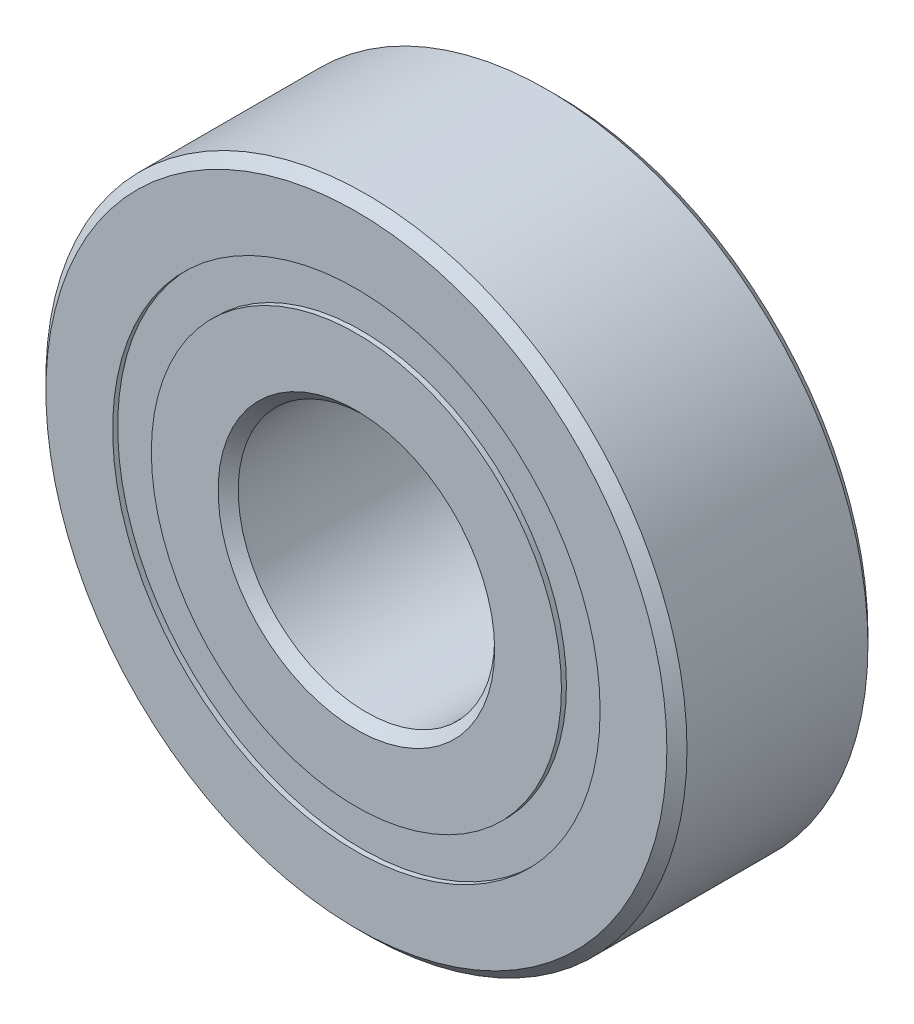
ISO-10303-21;
HEADER;
FILE_DESCRIPTION(('STEP AP214'),'2;1');
FILE_NAME('part.step','',(''),(''),'','','');
FILE_SCHEMA(('AUTOMOTIVE_DESIGN { 1 0 10303 214 1 1 1 1 }'));
ENDSEC;
DATA;
#1=APPLICATION_CONTEXT('core data for automotive mechanical design processes');
#2=APPLICATION_PROTOCOL_DEFINITION('international standard','automotive_design',2000,#1);
#3=PRODUCT_CONTEXT('',#1,'mechanical');
#4=PRODUCT('Part','Part','',(#3));
#5=PRODUCT_RELATED_PRODUCT_CATEGORY('part','',(#4));
#6=PRODUCT_DEFINITION_FORMATION('','',#4);
#7=PRODUCT_DEFINITION_CONTEXT('part definition',#1,'design');
#8=PRODUCT_DEFINITION('design','',#6,#7);
#9=PRODUCT_DEFINITION_SHAPE('','',#8);
#10=(LENGTH_UNIT() NAMED_UNIT(*) SI_UNIT(.MILLI.,.METRE.));
#11=(NAMED_UNIT(*) PLANE_ANGLE_UNIT() SI_UNIT($,.RADIAN.));
#12=(NAMED_UNIT(*) SI_UNIT($,.STERADIAN.) SOLID_ANGLE_UNIT());
#13=UNCERTAINTY_MEASURE_WITH_UNIT(LENGTH_MEASURE(1.E-05),#10,'distance_accuracy_value','');
#14=(GEOMETRIC_REPRESENTATION_CONTEXT(3) GLOBAL_UNCERTAINTY_ASSIGNED_CONTEXT((#13)) GLOBAL_UNIT_ASSIGNED_CONTEXT((#10,
#11,#12)) REPRESENTATION_CONTEXT('',''));
#15=CARTESIAN_POINT('',(0.,0.,0.));
#16=DIRECTION('',(0.,0.,1.));
#17=DIRECTION('',(1.,0.,0.));
#18=AXIS2_PLACEMENT_3D('',#15,#16,#17);
#19=CARTESIAN_POINT('',(0.,6.03522142857143,-2.36474));
#20=DIRECTION('',(0.,0.,1.));
#21=DIRECTION('',(1.,0.,0.));
#22=AXIS2_PLACEMENT_3D('',#19,#20,#21);
#23=PLANE('',#22);
#24=CARTESIAN_POINT('',(0.,0.,-2.36474));
#25=DIRECTION('',(0.,0.,1.));
#26=DIRECTION('',(1.,0.,0.));
#27=AXIS2_PLACEMENT_3D('',#24,#25,#26);
#28=CIRCLE('',#27,6.03522142857143);
#29=CARTESIAN_POINT('',(6.03522142857143,0.,-2.36474));
#30=VERTEX_POINT('',#29);
#31=EDGE_CURVE('E60',#30,#30,#28,.T.);
#32=ORIENTED_EDGE('',*,*,#31,.F.);
#33=EDGE_LOOP('',(#32));
#34=FACE_BOUND('',#33,.T.);
#35=CARTESIAN_POINT('',(0.,0.,-2.36474));
#36=DIRECTION('',(0.,0.,1.));
#37=DIRECTION('',(1.,0.,0.));
#38=AXIS2_PLACEMENT_3D('',#35,#36,#37);
#39=CIRCLE('',#38,5.07727857142857);
#40=CARTESIAN_POINT('',(5.07727857142857,0.,-2.36474));
#41=VERTEX_POINT('',#40);
#42=EDGE_CURVE('E11',#41,#41,#39,.T.);
#43=ORIENTED_EDGE('',*,*,#42,.T.);
#44=EDGE_LOOP('',(#43));
#45=FACE_BOUND('',#44,.T.);
#46=ADVANCED_FACE('F46',(#34,#45),#23,.F.);
#47=CARTESIAN_POINT('',(0.,0.,2.4892));
#48=DIRECTION('',(0.,0.,1.));
#49=DIRECTION('',(1.,0.,0.));
#50=AXIS2_PLACEMENT_3D('',#47,#48,#49);
#51=CYLINDRICAL_SURFACE('',#50,5.07727857142857);
#52=ORIENTED_EDGE('',*,*,#42,.F.);
#53=EDGE_LOOP('',(#52));
#54=FACE_BOUND('',#53,.T.);
#55=CARTESIAN_POINT('',(0.,0.,-1.20554465033679));
#56=DIRECTION('',(0.,0.,1.));
#57=DIRECTION('',(1.,0.,0.));
#58=AXIS2_PLACEMENT_3D('',#55,#56,#57);
#59=CIRCLE('',#58,5.07727857142857);
#60=CARTESIAN_POINT('',(5.07727857142857,0.,-1.20554465033679));
#61=VERTEX_POINT('',#60);
#62=EDGE_CURVE('E52',#61,#61,#59,.T.);
#63=ORIENTED_EDGE('',*,*,#62,.T.);
#64=EDGE_LOOP('',(#63));
#65=FACE_BOUND('',#64,.T.);
#66=ADVANCED_FACE('F69',(#54,#65),#51,.F.);
#67=CARTESIAN_POINT('',(0.,6.03522142857143,-1.20554465033679));
#68=DIRECTION('',(0.,0.,-1.));
#69=DIRECTION('',(-1.,0.,0.));
#70=AXIS2_PLACEMENT_3D('',#67,#68,#69);
#71=PLANE('',#70);
#72=ORIENTED_EDGE('',*,*,#62,.F.);
#73=EDGE_LOOP('',(#72));
#74=FACE_BOUND('',#73,.T.);
#75=CARTESIAN_POINT('',(0.,0.,-1.20554465033679));
#76=DIRECTION('',(0.,0.,1.));
#77=DIRECTION('',(1.,0.,0.));
#78=AXIS2_PLACEMENT_3D('',#75,#76,#77);
#79=CIRCLE('',#78,6.03522142857143);
#80=CARTESIAN_POINT('',(6.03522142857143,0.,-1.20554465033679));
#81=VERTEX_POINT('',#80);
#82=EDGE_CURVE('E56',#81,#81,#79,.T.);
#83=ORIENTED_EDGE('',*,*,#82,.T.);
#84=EDGE_LOOP('',(#83));
#85=FACE_BOUND('',#84,.T.);
#86=ADVANCED_FACE('F73',(#74,#85),#71,.F.);
#87=CARTESIAN_POINT('',(0.,0.,2.4892));
#88=DIRECTION('',(0.,0.,1.));
#89=DIRECTION('',(1.,0.,0.));
#90=AXIS2_PLACEMENT_3D('',#87,#88,#89);
#91=CYLINDRICAL_SURFACE('',#90,6.03522142857143);
#92=ORIENTED_EDGE('',*,*,#82,.F.);
#93=EDGE_LOOP('',(#92));
#94=FACE_BOUND('',#93,.T.);
#95=ORIENTED_EDGE('',*,*,#31,.T.);
#96=EDGE_LOOP('',(#95));
#97=FACE_BOUND('',#96,.T.);
#98=ADVANCED_FACE('F66',(#94,#97),#91,.T.);
#99=CLOSED_SHELL('',(#46,#66,#86,#98));
#100=MANIFOLD_SOLID_BREP('B2',#99);
#101=CARTESIAN_POINT('',(0.,6.03522142857143,2.36474));
#102=DIRECTION('',(0.,0.,-1.));
#103=DIRECTION('',(-1.,0.,0.));
#104=AXIS2_PLACEMENT_3D('',#101,#102,#103);
#105=PLANE('',#104);
#106=CARTESIAN_POINT('',(0.,0.,2.36474));
#107=DIRECTION('',(0.,0.,1.));
#108=DIRECTION('',(1.,0.,0.));
#109=AXIS2_PLACEMENT_3D('',#106,#107,#108);
#110=CIRCLE('',#109,5.07727857142857);
#111=CARTESIAN_POINT('',(5.07727857142857,0.,2.36474));
#112=VERTEX_POINT('',#111);
#113=EDGE_CURVE('E45',#112,#112,#110,.T.);
#114=ORIENTED_EDGE('',*,*,#113,.F.);
#115=EDGE_LOOP('',(#114));
#116=FACE_BOUND('',#115,.T.);
#117=CARTESIAN_POINT('',(0.,0.,2.36474));
#118=DIRECTION('',(0.,0.,1.));
#119=DIRECTION('',(1.,0.,0.));
#120=AXIS2_PLACEMENT_3D('',#117,#118,#119);
#121=CIRCLE('',#120,6.03522142857143);
#122=CARTESIAN_POINT('',(6.03522142857143,0.,2.36474));
#123=VERTEX_POINT('',#122);
#124=EDGE_CURVE('E128',#123,#123,#121,.T.);
#125=ORIENTED_EDGE('',*,*,#124,.T.);
#126=EDGE_LOOP('',(#125));
#127=FACE_BOUND('',#126,.T.);
#128=ADVANCED_FACE('F114',(#116,#127),#105,.F.);
#129=CARTESIAN_POINT('',(0.,0.,2.4892));
#130=DIRECTION('',(0.,0.,1.));
#131=DIRECTION('',(1.,0.,0.));
#132=AXIS2_PLACEMENT_3D('',#129,#130,#131);
#133=CYLINDRICAL_SURFACE('',#132,5.07727857142857);
#134=CARTESIAN_POINT('',(0.,0.,1.20554465033679));
#135=DIRECTION('',(0.,0.,1.));
#136=DIRECTION('',(1.,0.,0.));
#137=AXIS2_PLACEMENT_3D('',#134,#135,#136);
#138=CIRCLE('',#137,5.07727857142857);
#139=CARTESIAN_POINT('',(5.07727857142857,0.,1.20554465033679));
#140=VERTEX_POINT('',#139);
#141=EDGE_CURVE('E120',#140,#140,#138,.T.);
#142=ORIENTED_EDGE('',*,*,#141,.F.);
#143=EDGE_LOOP('',(#142));
#144=FACE_BOUND('',#143,.T.);
#145=ORIENTED_EDGE('',*,*,#113,.T.);
#146=EDGE_LOOP('',(#145));
#147=FACE_BOUND('',#146,.T.);
#148=ADVANCED_FACE('F143',(#144,#147),#133,.F.);
#149=CARTESIAN_POINT('',(0.,6.03522142857143,1.20554465033679));
#150=DIRECTION('',(0.,0.,1.));
#151=DIRECTION('',(1.,0.,0.));
#152=AXIS2_PLACEMENT_3D('',#149,#150,#151);
#153=PLANE('',#152);
#154=CARTESIAN_POINT('',(0.,0.,1.20554465033679));
#155=DIRECTION('',(0.,0.,1.));
#156=DIRECTION('',(1.,0.,0.));
#157=AXIS2_PLACEMENT_3D('',#154,#155,#156);
#158=CIRCLE('',#157,6.03522142857143);
#159=CARTESIAN_POINT('',(6.03522142857143,0.,1.20554465033679));
#160=VERTEX_POINT('',#159);
#161=EDGE_CURVE('E124',#160,#160,#158,.T.);
#162=ORIENTED_EDGE('',*,*,#161,.F.);
#163=EDGE_LOOP('',(#162));
#164=FACE_BOUND('',#163,.T.);
#165=ORIENTED_EDGE('',*,*,#141,.T.);
#166=EDGE_LOOP('',(#165));
#167=FACE_BOUND('',#166,.T.);
#168=ADVANCED_FACE('F138',(#164,#167),#153,.F.);
#169=CARTESIAN_POINT('',(0.,0.,2.4892));
#170=DIRECTION('',(0.,0.,1.));
#171=DIRECTION('',(1.,0.,0.));
#172=AXIS2_PLACEMENT_3D('',#169,#170,#171);
#173=CYLINDRICAL_SURFACE('',#172,6.03522142857143);
#174=ORIENTED_EDGE('',*,*,#124,.F.);
#175=EDGE_LOOP('',(#174));
#176=FACE_BOUND('',#175,.T.);
#177=ORIENTED_EDGE('',*,*,#161,.T.);
#178=EDGE_LOOP('',(#177));
#179=FACE_BOUND('',#178,.T.);
#180=ADVANCED_FACE('F135',(#176,#179),#173,.T.);
#181=CLOSED_SHELL('',(#128,#148,#168,#180));
#182=MANIFOLD_SOLID_BREP('B6',#181);
#183=CARTESIAN_POINT('',(-3.92886205296771,3.9288620529678,0.));
#184=DIRECTION('',(0.,0.,1.));
#185=DIRECTION('',(-0.707106781186539,0.707106781186556,0.));
#186=AXIS2_PLACEMENT_3D('',#183,#184,#185);
#187=SPHERICAL_SURFACE('',#186,1.20554465033679);
#188=CARTESIAN_POINT('',(-3.92886205296771,3.9288620529678,1.20554465033679));
#189=VERTEX_POINT('',#188);
#190=VERTEX_LOOP('',#189);
#191=FACE_BOUND('',#190,.T.);
#192=ADVANCED_FACE('F182',(#191),#187,.T.);
#193=CLOSED_SHELL('',(#192));
#194=MANIFOLD_SOLID_BREP('B40',#193);
#195=CARTESIAN_POINT('',(-5.55625,0.,0.));
#196=DIRECTION('',(0.,0.,1.));
#197=DIRECTION('',(-1.,0.,0.));
#198=AXIS2_PLACEMENT_3D('',#195,#196,#197);
#199=SPHERICAL_SURFACE('',#198,1.20554465033679);
#200=CARTESIAN_POINT('',(-5.55625,0.,1.20554465033679));
#201=VERTEX_POINT('',#200);
#202=VERTEX_LOOP('',#201);
#203=FACE_BOUND('',#202,.T.);
#204=ADVANCED_FACE('F203',(#203),#199,.T.);
#205=CLOSED_SHELL('',(#204));
#206=MANIFOLD_SOLID_BREP('B110',#205);
#207=CARTESIAN_POINT('',(-3.92886205296779,-3.92886205296772,0.));
#208=DIRECTION('',(0.,0.,1.));
#209=DIRECTION('',(-0.707106781186554,-0.707106781186541,0.));
#210=AXIS2_PLACEMENT_3D('',#207,#208,#209);
#211=SPHERICAL_SURFACE('',#210,1.20554465033679);
#212=CARTESIAN_POINT('',(-3.92886205296779,-3.92886205296772,1.20554465033679));
#213=VERTEX_POINT('',#212);
#214=VERTEX_LOOP('',#213);
#215=FACE_BOUND('',#214,.T.);
#216=ADVANCED_FACE('F224',(#215),#211,.T.);
#217=CLOSED_SHELL('',(#216));
#218=MANIFOLD_SOLID_BREP('B178',#217);
#219=CARTESIAN_POINT('',(0.,-5.55625,0.));
#220=DIRECTION('',(0.,0.,1.));
#221=DIRECTION('',(0.,-1.,0.));
#222=AXIS2_PLACEMENT_3D('',#219,#220,#221);
#223=SPHERICAL_SURFACE('',#222,1.20554465033679);
#224=CARTESIAN_POINT('',(0.,-5.55625,1.20554465033679));
#225=VERTEX_POINT('',#224);
#226=VERTEX_LOOP('',#225);
#227=FACE_BOUND('',#226,.T.);
#228=ADVANCED_FACE('F245',(#227),#223,.T.);
#229=CLOSED_SHELL('',(#228));
#230=MANIFOLD_SOLID_BREP('B199',#229);
#231=CARTESIAN_POINT('',(3.92886205296773,-3.92886205296778,0.));
#232=DIRECTION('',(0.,0.,1.));
#233=DIRECTION('',(0.707106781186544,-0.707106781186551,0.));
#234=AXIS2_PLACEMENT_3D('',#231,#232,#233);
#235=SPHERICAL_SURFACE('',#234,1.20554465033679);
#236=CARTESIAN_POINT('',(3.92886205296773,-3.92886205296778,1.20554465033679));
#237=VERTEX_POINT('',#236);
#238=VERTEX_LOOP('',#237);
#239=FACE_BOUND('',#238,.T.);
#240=ADVANCED_FACE('F266',(#239),#235,.T.);
#241=CLOSED_SHELL('',(#240));
#242=MANIFOLD_SOLID_BREP('B220',#241);
#243=CARTESIAN_POINT('',(5.55625,0.,0.));
#244=DIRECTION('',(0.,0.,1.));
#245=DIRECTION('',(1.,0.,0.));
#246=AXIS2_PLACEMENT_3D('',#243,#244,#245);
#247=SPHERICAL_SURFACE('',#246,1.20554465033679);
#248=CARTESIAN_POINT('',(5.55625,0.,1.20554465033679));
#249=VERTEX_POINT('',#248);
#250=VERTEX_LOOP('',#249);
#251=FACE_BOUND('',#250,.T.);
#252=ADVANCED_FACE('F287',(#251),#247,.T.);
#253=CLOSED_SHELL('',(#252));
#254=MANIFOLD_SOLID_BREP('B241',#253);
#255=CARTESIAN_POINT('',(3.92886205296776,3.92886205296775,0.));
#256=DIRECTION('',(0.,0.,1.));
#257=DIRECTION('',(0.707106781186549,0.707106781186546,0.));
#258=AXIS2_PLACEMENT_3D('',#255,#256,#257);
#259=SPHERICAL_SURFACE('',#258,1.20554465033679);
#260=CARTESIAN_POINT('',(3.92886205296776,3.92886205296775,1.20554465033679));
#261=VERTEX_POINT('',#260);
#262=VERTEX_LOOP('',#261);
#263=FACE_BOUND('',#262,.T.);
#264=ADVANCED_FACE('F308',(#263),#259,.T.);
#265=CLOSED_SHELL('',(#264));
#266=MANIFOLD_SOLID_BREP('B262',#265);
#267=CARTESIAN_POINT('',(0.,5.55625,0.));
#268=DIRECTION('',(0.,0.,1.));
#269=DIRECTION('',(0.,1.,0.));
#270=AXIS2_PLACEMENT_3D('',#267,#268,#269);
#271=SPHERICAL_SURFACE('',#270,1.20554465033679);
#272=CARTESIAN_POINT('',(0.,5.55625,1.20554465033679));
#273=VERTEX_POINT('',#272);
#274=VERTEX_LOOP('',#273);
#275=FACE_BOUND('',#274,.T.);
#276=ADVANCED_FACE('F331',(#275),#271,.T.);
#277=CLOSED_SHELL('',(#276));
#278=MANIFOLD_SOLID_BREP('B283',#277);
#279=CARTESIAN_POINT('',(0.,5.07727857142857,2.4892));
#280=DIRECTION('',(0.,0.,-1.));
#281=DIRECTION('',(-1.,0.,0.));
#282=AXIS2_PLACEMENT_3D('',#279,#280,#281);
#283=PLANE('',#282);
#284=CARTESIAN_POINT('',(0.,0.,2.4892));
#285=DIRECTION('',(0.,0.,1.));
#286=DIRECTION('',(1.,0.,0.));
#287=AXIS2_PLACEMENT_3D('',#284,#285,#286);
#288=CIRCLE('',#287,3.42392);
#289=CARTESIAN_POINT('',(3.42392,0.,2.4892));
#290=VERTEX_POINT('',#289);
#291=EDGE_CURVE('E379',#290,#290,#288,.T.);
#292=ORIENTED_EDGE('',*,*,#291,.F.);
#293=EDGE_LOOP('',(#292));
#294=FACE_BOUND('',#293,.T.);
#295=CARTESIAN_POINT('',(0.,0.,2.4892));
#296=DIRECTION('',(0.,0.,1.));
#297=DIRECTION('',(1.,0.,0.));
#298=AXIS2_PLACEMENT_3D('',#295,#296,#297);
#299=CIRCLE('',#298,5.07727857142857);
#300=CARTESIAN_POINT('',(5.07727857142857,0.,2.4892));
#301=VERTEX_POINT('',#300);
#302=EDGE_CURVE('E330',#301,#301,#299,.T.);
#303=ORIENTED_EDGE('',*,*,#302,.T.);
#304=EDGE_LOOP('',(#303));
#305=FACE_BOUND('',#304,.T.);
#306=ADVANCED_FACE('F351',(#294,#305),#283,.F.);
#307=CARTESIAN_POINT('',(0.,0.,2.4892));
#308=DIRECTION('',(0.,0.,1.));
#309=DIRECTION('',(1.,0.,0.));
#310=AXIS2_PLACEMENT_3D('',#307,#308,#309);
#311=CYLINDRICAL_SURFACE('',#310,5.07727857142857);
#312=ORIENTED_EDGE('',*,*,#302,.F.);
#313=EDGE_LOOP('',(#312));
#314=FACE_BOUND('',#313,.T.);
#315=CARTESIAN_POINT('',(0.,0.,1.10631111111111));
#316=DIRECTION('',(0.,0.,1.));
#317=DIRECTION('',(1.,0.,0.));
#318=AXIS2_PLACEMENT_3D('',#315,#316,#317);
#319=CIRCLE('',#318,5.07727857142857);
#320=CARTESIAN_POINT('',(5.07727857142857,0.,1.10631111111111));
#321=VERTEX_POINT('',#320);
#322=EDGE_CURVE('E357',#321,#321,#319,.T.);
#323=ORIENTED_EDGE('',*,*,#322,.T.);
#324=EDGE_LOOP('',(#323));
#325=FACE_BOUND('',#324,.T.);
#326=ADVANCED_FACE('F386',(#314,#325),#311,.T.);
#327=CARTESIAN_POINT('',(0.,0.,0.));
#328=DIRECTION('',(0.,0.,1.));
#329=DIRECTION('',(1.,0.,0.));
#330=AXIS2_PLACEMENT_3D('',#327,#328,#329);
#331=TOROIDAL_SURFACE('',#330,5.55625,1.20554465033679);
#332=ORIENTED_EDGE('',*,*,#322,.F.);
#333=EDGE_LOOP('',(#332));
#334=FACE_BOUND('',#333,.T.);
#335=CARTESIAN_POINT('',(0.,0.,-1.10631111111111));
#336=DIRECTION('',(0.,0.,1.));
#337=DIRECTION('',(1.,0.,0.));
#338=AXIS2_PLACEMENT_3D('',#335,#336,#337);
#339=CIRCLE('',#338,5.07727857142857);
#340=CARTESIAN_POINT('',(5.07727857142857,0.,-1.10631111111111));
#341=VERTEX_POINT('',#340);
#342=EDGE_CURVE('E361',#341,#341,#339,.T.);
#343=ORIENTED_EDGE('',*,*,#342,.T.);
#344=EDGE_LOOP('',(#343));
#345=FACE_BOUND('',#344,.T.);
#346=ADVANCED_FACE('F390',(#334,#345),#331,.F.);
#347=CARTESIAN_POINT('',(0.,0.,2.4892));
#348=DIRECTION('',(0.,0.,1.));
#349=DIRECTION('',(1.,0.,0.));
#350=AXIS2_PLACEMENT_3D('',#347,#348,#349);
#351=CYLINDRICAL_SURFACE('',#350,5.07727857142857);
#352=ORIENTED_EDGE('',*,*,#342,.F.);
#353=EDGE_LOOP('',(#352));
#354=FACE_BOUND('',#353,.T.);
#355=CARTESIAN_POINT('',(0.,0.,-2.4892));
#356=DIRECTION('',(0.,0.,1.));
#357=DIRECTION('',(1.,0.,0.));
#358=AXIS2_PLACEMENT_3D('',#355,#356,#357);
#359=CIRCLE('',#358,5.07727857142857);
#360=CARTESIAN_POINT('',(5.07727857142857,0.,-2.4892));
#361=VERTEX_POINT('',#360);
#362=EDGE_CURVE('E365',#361,#361,#359,.T.);
#363=ORIENTED_EDGE('',*,*,#362,.T.);
#364=EDGE_LOOP('',(#363));
#365=FACE_BOUND('',#364,.T.);
#366=ADVANCED_FACE('F395',(#354,#365),#351,.T.);
#367=CARTESIAN_POINT('',(0.,3.42392,-2.4892));
#368=DIRECTION('',(0.,0.,1.));
#369=DIRECTION('',(1.,0.,0.));
#370=AXIS2_PLACEMENT_3D('',#367,#368,#369);
#371=PLANE('',#370);
#372=ORIENTED_EDGE('',*,*,#362,.F.);
#373=EDGE_LOOP('',(#372));
#374=FACE_BOUND('',#373,.T.);
#375=CARTESIAN_POINT('',(0.,0.,-2.4892));
#376=DIRECTION('',(0.,0.,1.));
#377=DIRECTION('',(1.,0.,0.));
#378=AXIS2_PLACEMENT_3D('',#375,#376,#377);
#379=CIRCLE('',#378,3.42392);
#380=CARTESIAN_POINT('',(3.42392,0.,-2.4892));
#381=VERTEX_POINT('',#380);
#382=EDGE_CURVE('E370',#381,#381,#379,.T.);
#383=ORIENTED_EDGE('',*,*,#382,.T.);
#384=EDGE_LOOP('',(#383));
#385=FACE_BOUND('',#384,.T.);
#386=ADVANCED_FACE('F401',(#374,#385),#371,.F.);
#387=CARTESIAN_POINT('',(0.,0.,-2.24028));
#388=DIRECTION('',(0.,0.,-1.));
#389=DIRECTION('',(-1.,0.,0.));
#390=AXIS2_PLACEMENT_3D('',#387,#388,#389);
#391=CONICAL_SURFACE('',#390,3.175,0.78539816339744);
#392=ORIENTED_EDGE('',*,*,#382,.F.);
#393=EDGE_LOOP('',(#392));
#394=FACE_BOUND('',#393,.T.);
#395=CARTESIAN_POINT('',(0.,0.,-2.24028));
#396=DIRECTION('',(0.,0.,1.));
#397=DIRECTION('',(1.,0.,0.));
#398=AXIS2_PLACEMENT_3D('',#395,#396,#397);
#399=CIRCLE('',#398,3.175);
#400=CARTESIAN_POINT('',(3.175,0.,-2.24028));
#401=VERTEX_POINT('',#400);
#402=EDGE_CURVE('E373',#401,#401,#399,.T.);
#403=ORIENTED_EDGE('',*,*,#402,.T.);
#404=EDGE_LOOP('',(#403));
#405=FACE_BOUND('',#404,.T.);
#406=ADVANCED_FACE('F405',(#394,#405),#391,.F.);
#407=CARTESIAN_POINT('',(0.,0.,2.4892));
#408=DIRECTION('',(0.,0.,1.));
#409=DIRECTION('',(1.,0.,0.));
#410=AXIS2_PLACEMENT_3D('',#407,#408,#409);
#411=CYLINDRICAL_SURFACE('',#410,3.175);
#412=ORIENTED_EDGE('',*,*,#402,.F.);
#413=EDGE_LOOP('',(#412));
#414=FACE_BOUND('',#413,.T.);
#415=CARTESIAN_POINT('',(0.,0.,2.24028));
#416=DIRECTION('',(0.,0.,1.));
#417=DIRECTION('',(1.,0.,0.));
#418=AXIS2_PLACEMENT_3D('',#415,#416,#417);
#419=CIRCLE('',#418,3.175);
#420=CARTESIAN_POINT('',(3.175,0.,2.24028));
#421=VERTEX_POINT('',#420);
#422=EDGE_CURVE('E376',#421,#421,#419,.T.);
#423=ORIENTED_EDGE('',*,*,#422,.T.);
#424=EDGE_LOOP('',(#423));
#425=FACE_BOUND('',#424,.T.);
#426=ADVANCED_FACE('F409',(#414,#425),#411,.F.);
#427=CARTESIAN_POINT('',(0.,0.,2.4892));
#428=DIRECTION('',(0.,0.,1.));
#429=DIRECTION('',(1.,0.,0.));
#430=AXIS2_PLACEMENT_3D('',#427,#428,#429);
#431=CONICAL_SURFACE('',#430,3.42392,0.785398163397456);
#432=ORIENTED_EDGE('',*,*,#422,.F.);
#433=EDGE_LOOP('',(#432));
#434=FACE_BOUND('',#433,.T.);
#435=ORIENTED_EDGE('',*,*,#291,.T.);
#436=EDGE_LOOP('',(#435));
#437=FACE_BOUND('',#436,.T.);
#438=ADVANCED_FACE('F383',(#434,#437),#431,.F.);
#439=CLOSED_SHELL('',(#306,#326,#346,#366,#386,#406,#426,#438));
#440=MANIFOLD_SOLID_BREP('B304',#439);
#441=CARTESIAN_POINT('',(0.,0.,2.24028));
#442=DIRECTION('',(0.,0.,-1.));
#443=DIRECTION('',(-1.,0.,0.));
#444=AXIS2_PLACEMENT_3D('',#441,#442,#443);
#445=CONICAL_SURFACE('',#444,7.9375,0.785398163397445);
#446=CARTESIAN_POINT('',(0.,0.,2.4892));
#447=DIRECTION('',(0.,0.,1.));
#448=DIRECTION('',(1.,0.,0.));
#449=AXIS2_PLACEMENT_3D('',#446,#447,#448);
#450=CIRCLE('',#449,7.68858);
#451=CARTESIAN_POINT('',(7.68858,0.,2.4892));
#452=VERTEX_POINT('',#451);
#453=EDGE_CURVE('E501',#452,#452,#450,.T.);
#454=ORIENTED_EDGE('',*,*,#453,.F.);
#455=EDGE_LOOP('',(#454));
#456=FACE_BOUND('',#455,.T.);
#457=CARTESIAN_POINT('',(0.,0.,2.24028));
#458=DIRECTION('',(0.,0.,1.));
#459=DIRECTION('',(1.,0.,0.));
#460=AXIS2_PLACEMENT_3D('',#457,#458,#459);
#461=CIRCLE('',#460,7.9375);
#462=CARTESIAN_POINT('',(7.9375,0.,2.24028));
#463=VERTEX_POINT('',#462);
#464=EDGE_CURVE('E350',#463,#463,#461,.T.);
#465=ORIENTED_EDGE('',*,*,#464,.T.);
#466=EDGE_LOOP('',(#465));
#467=FACE_BOUND('',#466,.T.);
#468=ADVANCED_FACE('F473',(#456,#467),#445,.T.);
#469=CARTESIAN_POINT('',(0.,0.,2.4892));
#470=DIRECTION('',(0.,0.,1.));
#471=DIRECTION('',(1.,0.,0.));
#472=AXIS2_PLACEMENT_3D('',#469,#470,#471);
#473=CYLINDRICAL_SURFACE('',#472,7.9375);
#474=ORIENTED_EDGE('',*,*,#464,.F.);
#475=EDGE_LOOP('',(#474));
#476=FACE_BOUND('',#475,.T.);
#477=CARTESIAN_POINT('',(0.,0.,-2.24028));
#478=DIRECTION('',(0.,0.,1.));
#479=DIRECTION('',(1.,0.,0.));
#480=AXIS2_PLACEMENT_3D('',#477,#478,#479);
#481=CIRCLE('',#480,7.9375);
#482=CARTESIAN_POINT('',(7.9375,0.,-2.24028));
#483=VERTEX_POINT('',#482);
#484=EDGE_CURVE('E479',#483,#483,#481,.T.);
#485=ORIENTED_EDGE('',*,*,#484,.T.);
#486=EDGE_LOOP('',(#485));
#487=FACE_BOUND('',#486,.T.);
#488=ADVANCED_FACE('F508',(#476,#487),#473,.T.);
#489=CARTESIAN_POINT('',(0.,0.,-2.4892));
#490=DIRECTION('',(0.,0.,1.));
#491=DIRECTION('',(1.,0.,0.));
#492=AXIS2_PLACEMENT_3D('',#489,#490,#491);
#493=CONICAL_SURFACE('',#492,7.68858,0.785398163397443);
#494=ORIENTED_EDGE('',*,*,#484,.F.);
#495=EDGE_LOOP('',(#494));
#496=FACE_BOUND('',#495,.T.);
#497=CARTESIAN_POINT('',(0.,0.,-2.4892));
#498=DIRECTION('',(0.,0.,1.));
#499=DIRECTION('',(1.,0.,0.));
#500=AXIS2_PLACEMENT_3D('',#497,#498,#499);
#501=CIRCLE('',#500,7.68858);
#502=CARTESIAN_POINT('',(7.68858,0.,-2.4892));
#503=VERTEX_POINT('',#502);
#504=EDGE_CURVE('E483',#503,#503,#501,.T.);
#505=ORIENTED_EDGE('',*,*,#504,.T.);
#506=EDGE_LOOP('',(#505));
#507=FACE_BOUND('',#506,.T.);
#508=ADVANCED_FACE('F512',(#496,#507),#493,.T.);
#509=CARTESIAN_POINT('',(0.,7.68858,-2.4892));
#510=DIRECTION('',(0.,0.,1.));
#511=DIRECTION('',(1.,0.,0.));
#512=AXIS2_PLACEMENT_3D('',#509,#510,#511);
#513=PLANE('',#512);
#514=ORIENTED_EDGE('',*,*,#504,.F.);
#515=EDGE_LOOP('',(#514));
#516=FACE_BOUND('',#515,.T.);
#517=CARTESIAN_POINT('',(0.,0.,-2.4892));
#518=DIRECTION('',(0.,0.,1.));
#519=DIRECTION('',(1.,0.,0.));
#520=AXIS2_PLACEMENT_3D('',#517,#518,#519);
#521=CIRCLE('',#520,6.03522142857143);
#522=CARTESIAN_POINT('',(6.03522142857143,0.,-2.4892));
#523=VERTEX_POINT('',#522);
#524=EDGE_CURVE('E487',#523,#523,#521,.T.);
#525=ORIENTED_EDGE('',*,*,#524,.T.);
#526=EDGE_LOOP('',(#525));
#527=FACE_BOUND('',#526,.T.);
#528=ADVANCED_FACE('F517',(#516,#527),#513,.F.);
#529=CARTESIAN_POINT('',(0.,0.,2.4892));
#530=DIRECTION('',(0.,0.,1.));
#531=DIRECTION('',(1.,0.,0.));
#532=AXIS2_PLACEMENT_3D('',#529,#530,#531);
#533=CYLINDRICAL_SURFACE('',#532,6.03522142857143);
#534=ORIENTED_EDGE('',*,*,#524,.F.);
#535=EDGE_LOOP('',(#534));
#536=FACE_BOUND('',#535,.T.);
#537=CARTESIAN_POINT('',(0.,0.,-1.10631111111111));
#538=DIRECTION('',(0.,0.,1.));
#539=DIRECTION('',(1.,0.,0.));
#540=AXIS2_PLACEMENT_3D('',#537,#538,#539);
#541=CIRCLE('',#540,6.03522142857143);
#542=CARTESIAN_POINT('',(6.03522142857143,0.,-1.10631111111111));
#543=VERTEX_POINT('',#542);
#544=EDGE_CURVE('E492',#543,#543,#541,.T.);
#545=ORIENTED_EDGE('',*,*,#544,.T.);
#546=EDGE_LOOP('',(#545));
#547=FACE_BOUND('',#546,.T.);
#548=ADVANCED_FACE('F523',(#536,#547),#533,.F.);
#549=CARTESIAN_POINT('',(0.,0.,0.));
#550=DIRECTION('',(0.,0.,1.));
#551=DIRECTION('',(1.,0.,0.));
#552=AXIS2_PLACEMENT_3D('',#549,#550,#551);
#553=TOROIDAL_SURFACE('',#552,5.55625,1.20554465033679);
#554=ORIENTED_EDGE('',*,*,#544,.F.);
#555=EDGE_LOOP('',(#554));
#556=FACE_BOUND('',#555,.T.);
#557=CARTESIAN_POINT('',(0.,0.,1.10631111111111));
#558=DIRECTION('',(0.,0.,1.));
#559=DIRECTION('',(1.,0.,0.));
#560=AXIS2_PLACEMENT_3D('',#557,#558,#559);
#561=CIRCLE('',#560,6.03522142857143);
#562=CARTESIAN_POINT('',(6.03522142857143,0.,1.10631111111111));
#563=VERTEX_POINT('',#562);
#564=EDGE_CURVE('E495',#563,#563,#561,.T.);
#565=ORIENTED_EDGE('',*,*,#564,.T.);
#566=EDGE_LOOP('',(#565));
#567=FACE_BOUND('',#566,.T.);
#568=ADVANCED_FACE('F527',(#556,#567),#553,.F.);
#569=CARTESIAN_POINT('',(0.,0.,2.4892));
#570=DIRECTION('',(0.,0.,1.));
#571=DIRECTION('',(1.,0.,0.));
#572=AXIS2_PLACEMENT_3D('',#569,#570,#571);
#573=CYLINDRICAL_SURFACE('',#572,6.03522142857143);
#574=ORIENTED_EDGE('',*,*,#564,.F.);
#575=EDGE_LOOP('',(#574));
#576=FACE_BOUND('',#575,.T.);
#577=CARTESIAN_POINT('',(0.,0.,2.4892));
#578=DIRECTION('',(0.,0.,1.));
#579=DIRECTION('',(1.,0.,0.));
#580=AXIS2_PLACEMENT_3D('',#577,#578,#579);
#581=CIRCLE('',#580,6.03522142857143);
#582=CARTESIAN_POINT('',(6.03522142857143,0.,2.4892));
#583=VERTEX_POINT('',#582);
#584=EDGE_CURVE('E498',#583,#583,#581,.T.);
#585=ORIENTED_EDGE('',*,*,#584,.T.);
#586=EDGE_LOOP('',(#585));
#587=FACE_BOUND('',#586,.T.);
#588=ADVANCED_FACE('F531',(#576,#587),#573,.F.);
#589=CARTESIAN_POINT('',(0.,7.68858,2.4892));
#590=DIRECTION('',(0.,0.,-1.));
#591=DIRECTION('',(-1.,0.,0.));
#592=AXIS2_PLACEMENT_3D('',#589,#590,#591);
#593=PLANE('',#592);
#594=ORIENTED_EDGE('',*,*,#584,.F.);
#595=EDGE_LOOP('',(#594));
#596=FACE_BOUND('',#595,.T.);
#597=ORIENTED_EDGE('',*,*,#453,.T.);
#598=EDGE_LOOP('',(#597));
#599=FACE_BOUND('',#598,.T.);
#600=ADVANCED_FACE('F505',(#596,#599),#593,.F.);
#601=CLOSED_SHELL('',(#468,#488,#508,#528,#548,#568,#588,#600));
#602=MANIFOLD_SOLID_BREP('B325',#601);
#603=ADVANCED_BREP_SHAPE_REPRESENTATION('',(#18,#100,#182,#194,#206,#218,#230,#242,#254,#266,
#278,#440,#602),#14);
#604=SHAPE_DEFINITION_REPRESENTATION(#9,#603);
ENDSEC;
END-ISO-10303-21;
